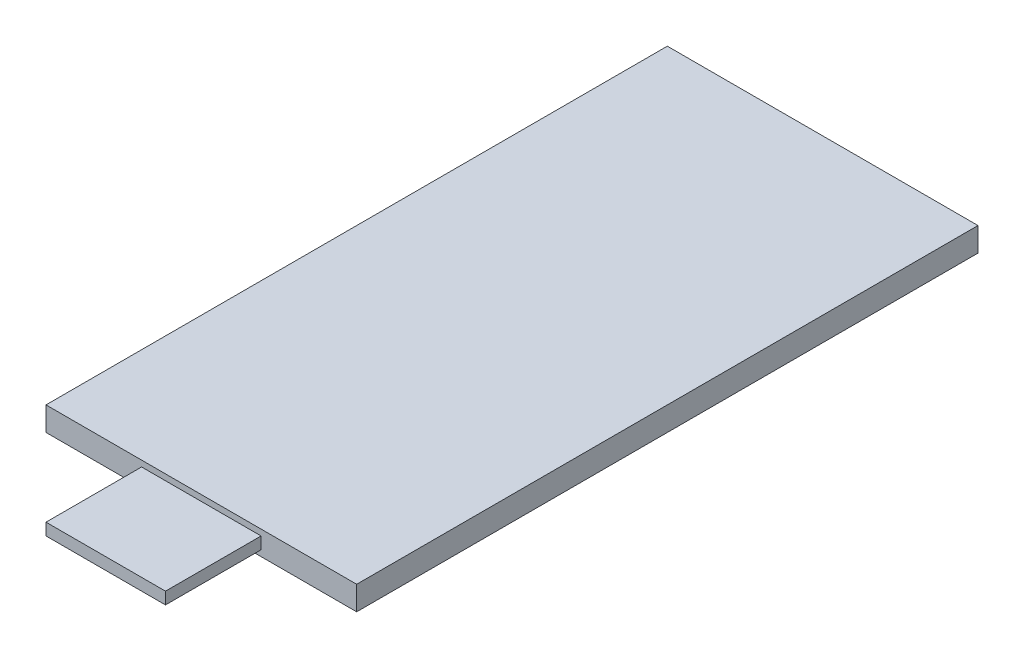
ISO-10303-21;
HEADER;
FILE_DESCRIPTION(('STEP AP214'),'2;1');
FILE_NAME('part.step','',(''),(''),'','','');
FILE_SCHEMA(('AUTOMOTIVE_DESIGN { 1 0 10303 214 1 1 1 1 }'));
ENDSEC;
DATA;
#1=APPLICATION_CONTEXT('core data for automotive mechanical design processes');
#2=APPLICATION_PROTOCOL_DEFINITION('international standard','automotive_design',2000,#1);
#3=PRODUCT_CONTEXT('',#1,'mechanical');
#4=PRODUCT('Part','Part','',(#3));
#5=PRODUCT_RELATED_PRODUCT_CATEGORY('part','',(#4));
#6=PRODUCT_DEFINITION_FORMATION('','',#4);
#7=PRODUCT_DEFINITION_CONTEXT('part definition',#1,'design');
#8=PRODUCT_DEFINITION('design','',#6,#7);
#9=PRODUCT_DEFINITION_SHAPE('','',#8);
#10=(LENGTH_UNIT() NAMED_UNIT(*) SI_UNIT(.MILLI.,.METRE.));
#11=(NAMED_UNIT(*) PLANE_ANGLE_UNIT() SI_UNIT($,.RADIAN.));
#12=(NAMED_UNIT(*) SI_UNIT($,.STERADIAN.) SOLID_ANGLE_UNIT());
#13=UNCERTAINTY_MEASURE_WITH_UNIT(LENGTH_MEASURE(1.E-05),#10,'distance_accuracy_value','');
#14=(GEOMETRIC_REPRESENTATION_CONTEXT(3) GLOBAL_UNCERTAINTY_ASSIGNED_CONTEXT((#13)) GLOBAL_UNIT_ASSIGNED_CONTEXT((#10,
#11,#12)) REPRESENTATION_CONTEXT('',''));
#15=CARTESIAN_POINT('',(0.,0.,0.));
#16=DIRECTION('',(0.,0.,1.));
#17=DIRECTION('',(1.,0.,0.));
#18=AXIS2_PLACEMENT_3D('',#15,#16,#17);
#19=CARTESIAN_POINT('',(-13.,2.,30.));
#20=DIRECTION('',(0.,0.,-1.));
#21=DIRECTION('',(-1.,0.,0.));
#22=AXIS2_PLACEMENT_3D('',#19,#20,#21);
#23=PLANE('',#22);
#24=DIRECTION('',(-1.,0.,0.));
#25=VECTOR('',#24,1.);
#26=CARTESIAN_POINT('',(-5.,0.5,30.));
#27=LINE('',#26,#25);
#28=CARTESIAN_POINT('',(5.,0.5,30.));
#29=VERTEX_POINT('',#28);
#30=CARTESIAN_POINT('',(-5.,0.5,30.));
#31=VERTEX_POINT('',#30);
#32=EDGE_CURVE('E152',#29,#31,#27,.T.);
#33=ORIENTED_EDGE('',*,*,#32,.F.);
#34=DIRECTION('',(0.,1.,0.));
#35=VECTOR('',#34,1.);
#36=CARTESIAN_POINT('',(5.,0.,30.));
#37=LINE('',#36,#35);
#38=CARTESIAN_POINT('',(5.,1.5,30.));
#39=VERTEX_POINT('',#38);
#40=EDGE_CURVE('E120',#29,#39,#37,.T.);
#41=ORIENTED_EDGE('',*,*,#40,.T.);
#42=DIRECTION('',(1.,0.,0.));
#43=VECTOR('',#42,1.);
#44=CARTESIAN_POINT('',(-5.,1.5,30.));
#45=LINE('',#44,#43);
#46=CARTESIAN_POINT('',(-5.,1.5,30.));
#47=VERTEX_POINT('',#46);
#48=EDGE_CURVE('E144',#47,#39,#45,.T.);
#49=ORIENTED_EDGE('',*,*,#48,.F.);
#50=DIRECTION('',(0.,1.,0.));
#51=VECTOR('',#50,1.);
#52=CARTESIAN_POINT('',(-5.,0.,30.));
#53=LINE('',#52,#51);
#54=EDGE_CURVE('E125',#31,#47,#53,.T.);
#55=ORIENTED_EDGE('',*,*,#54,.F.);
#56=EDGE_LOOP('',(#33,#41,#49,#55));
#57=FACE_BOUND('',#56,.T.);
#58=ADVANCED_FACE('F39',(#57),#23,.F.);
#59=CARTESIAN_POINT('',(5.,0.,30.));
#60=DIRECTION('',(-1.,0.,0.));
#61=DIRECTION('',(0.,0.,1.));
#62=AXIS2_PLACEMENT_3D('',#59,#60,#61);
#63=PLANE('',#62);
#64=DIRECTION('',(0.,0.,1.));
#65=VECTOR('',#64,1.);
#66=CARTESIAN_POINT('',(5.,0.5,30.));
#67=LINE('',#66,#65);
#68=CARTESIAN_POINT('',(5.,0.5,22.));
#69=VERTEX_POINT('',#68);
#70=EDGE_CURVE('E156',#69,#29,#67,.T.);
#71=ORIENTED_EDGE('',*,*,#70,.F.);
#72=DIRECTION('',(0.,1.,0.));
#73=VECTOR('',#72,1.);
#74=CARTESIAN_POINT('',(5.,0.,22.));
#75=LINE('',#74,#73);
#76=CARTESIAN_POINT('',(5.,1.5,22.));
#77=VERTEX_POINT('',#76);
#78=EDGE_CURVE('E115',#69,#77,#75,.T.);
#79=ORIENTED_EDGE('',*,*,#78,.T.);
#80=DIRECTION('',(0.,0.,-1.));
#81=VECTOR('',#80,1.);
#82=CARTESIAN_POINT('',(5.,1.5,22.));
#83=LINE('',#82,#81);
#84=EDGE_CURVE('E140',#39,#77,#83,.T.);
#85=ORIENTED_EDGE('',*,*,#84,.F.);
#86=ORIENTED_EDGE('',*,*,#40,.F.);
#87=EDGE_LOOP('',(#71,#79,#85,#86));
#88=FACE_BOUND('',#87,.T.);
#89=ADVANCED_FACE('F193',(#88),#63,.F.);
#90=CARTESIAN_POINT('',(-5.,0.,30.));
#91=DIRECTION('',(1.,0.,0.));
#92=DIRECTION('',(0.,0.,-1.));
#93=AXIS2_PLACEMENT_3D('',#90,#91,#92);
#94=PLANE('',#93);
#95=DIRECTION('',(0.,0.,-1.));
#96=VECTOR('',#95,1.);
#97=CARTESIAN_POINT('',(-5.,0.5,30.));
#98=LINE('',#97,#96);
#99=CARTESIAN_POINT('',(-4.99999999999999,0.5,22.));
#100=VERTEX_POINT('',#99);
#101=EDGE_CURVE('E164',#31,#100,#98,.T.);
#102=ORIENTED_EDGE('',*,*,#101,.F.);
#103=ORIENTED_EDGE('',*,*,#54,.T.);
#104=DIRECTION('',(0.,0.,1.));
#105=VECTOR('',#104,1.);
#106=CARTESIAN_POINT('',(-5.,1.5,22.));
#107=LINE('',#106,#105);
#108=CARTESIAN_POINT('',(-5.,1.5,22.));
#109=VERTEX_POINT('',#108);
#110=EDGE_CURVE('E148',#109,#47,#107,.T.);
#111=ORIENTED_EDGE('',*,*,#110,.F.);
#112=DIRECTION('',(0.,1.,0.));
#113=VECTOR('',#112,1.);
#114=CARTESIAN_POINT('',(-5.,0.,22.));
#115=LINE('',#114,#113);
#116=EDGE_CURVE('E55',#100,#109,#115,.T.);
#117=ORIENTED_EDGE('',*,*,#116,.F.);
#118=EDGE_LOOP('',(#102,#103,#111,#117));
#119=FACE_BOUND('',#118,.T.);
#120=ADVANCED_FACE('F179',(#119),#94,.F.);
#121=CARTESIAN_POINT('',(13.,2.,-30.));
#122=DIRECTION('',(-1.,0.,0.));
#123=DIRECTION('',(0.,0.,1.));
#124=AXIS2_PLACEMENT_3D('',#121,#122,#123);
#125=PLANE('',#124);
#126=DIRECTION('',(0.,0.,-1.));
#127=VECTOR('',#126,1.);
#128=CARTESIAN_POINT('',(13.,2.,-30.));
#129=LINE('',#128,#127);
#130=CARTESIAN_POINT('',(13.,2.,22.));
#131=VERTEX_POINT('',#130);
#132=CARTESIAN_POINT('',(13.,2.,-30.));
#133=VERTEX_POINT('',#132);
#134=EDGE_CURVE('E99',#131,#133,#129,.T.);
#135=ORIENTED_EDGE('',*,*,#134,.F.);
#136=DIRECTION('',(0.,1.,0.));
#137=VECTOR('',#136,1.);
#138=CARTESIAN_POINT('',(13.,0.,22.));
#139=LINE('',#138,#137);
#140=CARTESIAN_POINT('',(13.,0.,22.));
#141=VERTEX_POINT('',#140);
#142=EDGE_CURVE('E111',#141,#131,#139,.T.);
#143=ORIENTED_EDGE('',*,*,#142,.F.);
#144=DIRECTION('',(0.,0.,-1.));
#145=VECTOR('',#144,1.);
#146=CARTESIAN_POINT('',(13.,0.,-30.));
#147=LINE('',#146,#145);
#148=CARTESIAN_POINT('',(13.,0.,-30.));
#149=VERTEX_POINT('',#148);
#150=EDGE_CURVE('E86',#141,#149,#147,.T.);
#151=ORIENTED_EDGE('',*,*,#150,.T.);
#152=DIRECTION('',(0.,-1.,0.));
#153=VECTOR('',#152,1.);
#154=CARTESIAN_POINT('',(13.,2.,-30.));
#155=LINE('',#154,#153);
#156=EDGE_CURVE('E11',#133,#149,#155,.T.);
#157=ORIENTED_EDGE('',*,*,#156,.F.);
#158=EDGE_LOOP('',(#135,#143,#151,#157));
#159=FACE_BOUND('',#158,.T.);
#160=ADVANCED_FACE('F41',(#159),#125,.F.);
#161=CARTESIAN_POINT('',(-13.,2.,-30.));
#162=DIRECTION('',(0.,0.,1.));
#163=DIRECTION('',(1.,0.,0.));
#164=AXIS2_PLACEMENT_3D('',#161,#162,#163);
#165=PLANE('',#164);
#166=DIRECTION('',(-1.,0.,0.));
#167=VECTOR('',#166,1.);
#168=CARTESIAN_POINT('',(-13.,0.,-30.));
#169=LINE('',#168,#167);
#170=CARTESIAN_POINT('',(-13.,0.,-30.));
#171=VERTEX_POINT('',#170);
#172=EDGE_CURVE('E76',#149,#171,#169,.T.);
#173=ORIENTED_EDGE('',*,*,#172,.T.);
#174=DIRECTION('',(0.,-1.,0.));
#175=VECTOR('',#174,1.);
#176=CARTESIAN_POINT('',(-13.,2.,-30.));
#177=LINE('',#176,#175);
#178=CARTESIAN_POINT('',(-13.,2.,-30.));
#179=VERTEX_POINT('',#178);
#180=EDGE_CURVE('E48',#179,#171,#177,.T.);
#181=ORIENTED_EDGE('',*,*,#180,.F.);
#182=DIRECTION('',(-1.,0.,0.));
#183=VECTOR('',#182,1.);
#184=CARTESIAN_POINT('',(-13.,2.,-30.));
#185=LINE('',#184,#183);
#186=EDGE_CURVE('E64',#133,#179,#185,.T.);
#187=ORIENTED_EDGE('',*,*,#186,.F.);
#188=ORIENTED_EDGE('',*,*,#156,.T.);
#189=EDGE_LOOP('',(#173,#181,#187,#188));
#190=FACE_BOUND('',#189,.T.);
#191=ADVANCED_FACE('F78',(#190),#165,.F.);
#192=CARTESIAN_POINT('',(-13.,2.,-30.));
#193=DIRECTION('',(1.,0.,0.));
#194=DIRECTION('',(0.,0.,-1.));
#195=AXIS2_PLACEMENT_3D('',#192,#193,#194);
#196=PLANE('',#195);
#197=DIRECTION('',(0.,0.,1.));
#198=VECTOR('',#197,1.);
#199=CARTESIAN_POINT('',(-13.,0.,-30.));
#200=LINE('',#199,#198);
#201=CARTESIAN_POINT('',(-13.,0.,22.));
#202=VERTEX_POINT('',#201);
#203=EDGE_CURVE('E85',#171,#202,#200,.T.);
#204=ORIENTED_EDGE('',*,*,#203,.T.);
#205=DIRECTION('',(0.,1.,0.));
#206=VECTOR('',#205,1.);
#207=CARTESIAN_POINT('',(-13.,0.,22.));
#208=LINE('',#207,#206);
#209=CARTESIAN_POINT('',(-13.,2.,22.));
#210=VERTEX_POINT('',#209);
#211=EDGE_CURVE('E106',#202,#210,#208,.T.);
#212=ORIENTED_EDGE('',*,*,#211,.T.);
#213=DIRECTION('',(0.,0.,1.));
#214=VECTOR('',#213,1.);
#215=CARTESIAN_POINT('',(-13.,2.,-30.));
#216=LINE('',#215,#214);
#217=EDGE_CURVE('E92',#179,#210,#216,.T.);
#218=ORIENTED_EDGE('',*,*,#217,.F.);
#219=ORIENTED_EDGE('',*,*,#180,.T.);
#220=EDGE_LOOP('',(#204,#212,#218,#219));
#221=FACE_BOUND('',#220,.T.);
#222=ADVANCED_FACE('F90',(#221),#196,.F.);
#223=CARTESIAN_POINT('',(0.,2.,0.));
#224=DIRECTION('',(0.,1.,0.));
#225=DIRECTION('',(0.,0.,1.));
#226=AXIS2_PLACEMENT_3D('',#223,#224,#225);
#227=PLANE('',#226);
#228=DIRECTION('',(-1.,0.,0.));
#229=VECTOR('',#228,1.);
#230=CARTESIAN_POINT('',(-13.,2.,22.));
#231=LINE('',#230,#229);
#232=EDGE_CURVE('E124',#131,#210,#231,.T.);
#233=ORIENTED_EDGE('',*,*,#232,.F.);
#234=ORIENTED_EDGE('',*,*,#134,.T.);
#235=ORIENTED_EDGE('',*,*,#186,.T.);
#236=ORIENTED_EDGE('',*,*,#217,.T.);
#237=EDGE_LOOP('',(#233,#234,#235,#236));
#238=FACE_BOUND('',#237,.T.);
#239=ADVANCED_FACE('F207',(#238),#227,.T.);
#240=CARTESIAN_POINT('',(0.,0.,0.));
#241=DIRECTION('',(0.,1.,0.));
#242=DIRECTION('',(0.,0.,1.));
#243=AXIS2_PLACEMENT_3D('',#240,#241,#242);
#244=PLANE('',#243);
#245=ORIENTED_EDGE('',*,*,#150,.F.);
#246=DIRECTION('',(-1.,0.,0.));
#247=VECTOR('',#246,1.);
#248=CARTESIAN_POINT('',(-13.,0.,22.));
#249=LINE('',#248,#247);
#250=EDGE_CURVE('E97',#141,#202,#249,.T.);
#251=ORIENTED_EDGE('',*,*,#250,.T.);
#252=ORIENTED_EDGE('',*,*,#203,.F.);
#253=ORIENTED_EDGE('',*,*,#172,.F.);
#254=EDGE_LOOP('',(#245,#251,#252,#253));
#255=FACE_BOUND('',#254,.T.);
#256=ADVANCED_FACE('F95',(#255),#244,.F.);
#257=CARTESIAN_POINT('',(-13.,0.,22.));
#258=DIRECTION('',(0.,0.,-1.));
#259=DIRECTION('',(-1.,0.,0.));
#260=AXIS2_PLACEMENT_3D('',#257,#258,#259);
#261=PLANE('',#260);
#262=DIRECTION('',(1.,0.,0.));
#263=VECTOR('',#262,1.);
#264=CARTESIAN_POINT('',(-4.99999999999999,0.5,22.));
#265=LINE('',#264,#263);
#266=EDGE_CURVE('E160',#100,#69,#265,.T.);
#267=ORIENTED_EDGE('',*,*,#266,.F.);
#268=ORIENTED_EDGE('',*,*,#116,.T.);
#269=DIRECTION('',(-1.,0.,0.));
#270=VECTOR('',#269,1.);
#271=CARTESIAN_POINT('',(-5.,1.5,22.));
#272=LINE('',#271,#270);
#273=EDGE_CURVE('E116',#77,#109,#272,.T.);
#274=ORIENTED_EDGE('',*,*,#273,.F.);
#275=ORIENTED_EDGE('',*,*,#78,.F.);
#276=EDGE_LOOP('',(#267,#268,#274,#275));
#277=FACE_BOUND('',#276,.T.);
#278=ORIENTED_EDGE('',*,*,#232,.T.);
#279=ORIENTED_EDGE('',*,*,#211,.F.);
#280=ORIENTED_EDGE('',*,*,#250,.F.);
#281=ORIENTED_EDGE('',*,*,#142,.T.);
#282=EDGE_LOOP('',(#278,#279,#280,#281));
#283=FACE_BOUND('',#282,.T.);
#284=ADVANCED_FACE('F211',(#277,#283),#261,.F.);
#285=CARTESIAN_POINT('',(0.,1.5,0.));
#286=DIRECTION('',(0.,1.,0.));
#287=DIRECTION('',(0.,0.,1.));
#288=AXIS2_PLACEMENT_3D('',#285,#286,#287);
#289=PLANE('',#288);
#290=ORIENTED_EDGE('',*,*,#110,.T.);
#291=ORIENTED_EDGE('',*,*,#48,.T.);
#292=ORIENTED_EDGE('',*,*,#84,.T.);
#293=ORIENTED_EDGE('',*,*,#273,.T.);
#294=EDGE_LOOP('',(#290,#291,#292,#293));
#295=FACE_BOUND('',#294,.T.);
#296=ADVANCED_FACE('F183',(#295),#289,.T.);
#297=CARTESIAN_POINT('',(0.,0.5,0.));
#298=DIRECTION('',(0.,-1.,0.));
#299=DIRECTION('',(0.,0.,-1.));
#300=AXIS2_PLACEMENT_3D('',#297,#298,#299);
#301=PLANE('',#300);
#302=ORIENTED_EDGE('',*,*,#101,.T.);
#303=ORIENTED_EDGE('',*,*,#266,.T.);
#304=ORIENTED_EDGE('',*,*,#70,.T.);
#305=ORIENTED_EDGE('',*,*,#32,.T.);
#306=EDGE_LOOP('',(#302,#303,#304,#305));
#307=FACE_BOUND('',#306,.T.);
#308=ADVANCED_FACE('F170',(#307),#301,.T.);
#309=CLOSED_SHELL('',(#58,#89,#120,#160,#191,#222,#239,#256,#284,#296,#308));
#310=MANIFOLD_SOLID_BREP('B2',#309);
#311=ADVANCED_BREP_SHAPE_REPRESENTATION('',(#18,#310),#14);
#312=SHAPE_DEFINITION_REPRESENTATION(#9,#311);
ENDSEC;
END-ISO-10303-21;
